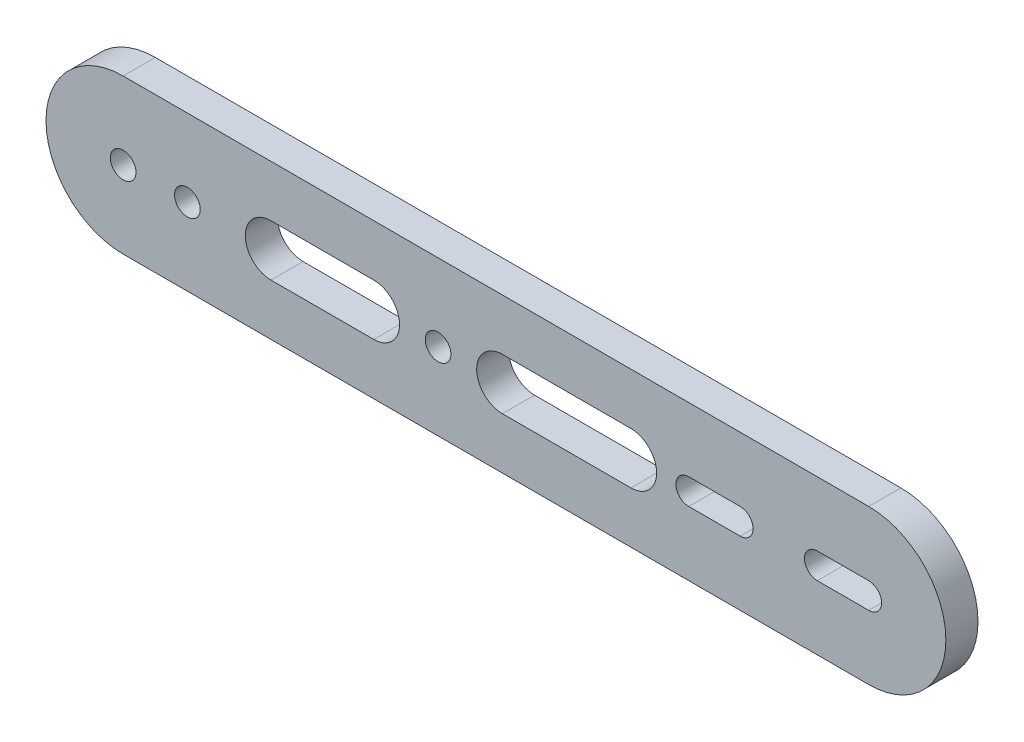
ISO-10303-21;
HEADER;
FILE_DESCRIPTION(('STEP AP214'),'2;1');
FILE_NAME('part.step','',(''),(''),'','','');
FILE_SCHEMA(('AUTOMOTIVE_DESIGN { 1 0 10303 214 1 1 1 1 }'));
ENDSEC;
DATA;
#1=APPLICATION_CONTEXT('core data for automotive mechanical design processes');
#2=APPLICATION_PROTOCOL_DEFINITION('international standard','automotive_design',2000,#1);
#3=PRODUCT_CONTEXT('',#1,'mechanical');
#4=PRODUCT('Part','Part','',(#3));
#5=PRODUCT_RELATED_PRODUCT_CATEGORY('part','',(#4));
#6=PRODUCT_DEFINITION_FORMATION('','',#4);
#7=PRODUCT_DEFINITION_CONTEXT('part definition',#1,'design');
#8=PRODUCT_DEFINITION('design','',#6,#7);
#9=PRODUCT_DEFINITION_SHAPE('','',#8);
#10=(LENGTH_UNIT() NAMED_UNIT(*) SI_UNIT(.MILLI.,.METRE.));
#11=(NAMED_UNIT(*) PLANE_ANGLE_UNIT() SI_UNIT($,.RADIAN.));
#12=(NAMED_UNIT(*) SI_UNIT($,.STERADIAN.) SOLID_ANGLE_UNIT());
#13=UNCERTAINTY_MEASURE_WITH_UNIT(LENGTH_MEASURE(1.E-05),#10,'distance_accuracy_value','');
#14=(GEOMETRIC_REPRESENTATION_CONTEXT(3) GLOBAL_UNCERTAINTY_ASSIGNED_CONTEXT((#13)) GLOBAL_UNIT_ASSIGNED_CONTEXT((#10,
#11,#12)) REPRESENTATION_CONTEXT('',''));
#15=CARTESIAN_POINT('',(0.,0.,0.));
#16=DIRECTION('',(0.,0.,1.));
#17=DIRECTION('',(1.,0.,0.));
#18=AXIS2_PLACEMENT_3D('',#15,#16,#17);
#19=CARTESIAN_POINT('',(0.,0.,5.));
#20=DIRECTION('',(0.,0.,1.));
#21=DIRECTION('',(1.,0.,0.));
#22=AXIS2_PLACEMENT_3D('',#19,#20,#21);
#23=PLANE('',#22);
#24=CARTESIAN_POINT('',(0.,0.,5.));
#25=DIRECTION('',(0.,0.,1.));
#26=DIRECTION('',(1.,0.,0.));
#27=AXIS2_PLACEMENT_3D('',#24,#25,#26);
#28=CIRCLE('',#27,2.);
#29=CARTESIAN_POINT('',(2.,0.,5.));
#30=VERTEX_POINT('',#29);
#31=EDGE_CURVE('E308',#30,#30,#28,.T.);
#32=ORIENTED_EDGE('',*,*,#31,.F.);
#33=EDGE_LOOP('',(#32));
#34=FACE_BOUND('',#33,.T.);
#35=CARTESIAN_POINT('',(0.,0.,5.));
#36=DIRECTION('',(0.,0.,1.));
#37=DIRECTION('',(1.,0.,0.));
#38=AXIS2_PLACEMENT_3D('',#35,#36,#37);
#39=CIRCLE('',#38,12.);
#40=CARTESIAN_POINT('',(0.,12.,5.));
#41=VERTEX_POINT('',#40);
#42=CARTESIAN_POINT('',(0.,-12.,5.));
#43=VERTEX_POINT('',#42);
#44=EDGE_CURVE('E320',#41,#43,#39,.T.);
#45=ORIENTED_EDGE('',*,*,#44,.T.);
#46=DIRECTION('',(1.,0.,0.));
#47=VECTOR('',#46,1.);
#48=CARTESIAN_POINT('',(0.,-12.,5.));
#49=LINE('',#48,#47);
#50=CARTESIAN_POINT('',(116.,-12.,5.));
#51=VERTEX_POINT('',#50);
#52=EDGE_CURVE('E323',#43,#51,#49,.T.);
#53=ORIENTED_EDGE('',*,*,#52,.T.);
#54=CARTESIAN_POINT('',(116.,0.,5.));
#55=DIRECTION('',(0.,0.,1.));
#56=DIRECTION('',(1.,0.,0.));
#57=AXIS2_PLACEMENT_3D('',#54,#55,#56);
#58=CIRCLE('',#57,12.);
#59=CARTESIAN_POINT('',(116.,12.,5.));
#60=VERTEX_POINT('',#59);
#61=EDGE_CURVE('E326',#51,#60,#58,.T.);
#62=ORIENTED_EDGE('',*,*,#61,.T.);
#63=DIRECTION('',(-1.,0.,0.));
#64=VECTOR('',#63,1.);
#65=CARTESIAN_POINT('',(0.,12.,5.));
#66=LINE('',#65,#64);
#67=EDGE_CURVE('E328',#60,#41,#66,.T.);
#68=ORIENTED_EDGE('',*,*,#67,.T.);
#69=EDGE_LOOP('',(#45,#53,#62,#68));
#70=FACE_BOUND('',#69,.T.);
#71=CARTESIAN_POINT('',(49.,0.,5.));
#72=DIRECTION('',(0.,0.,1.));
#73=DIRECTION('',(1.,0.,0.));
#74=AXIS2_PLACEMENT_3D('',#71,#72,#73);
#75=CIRCLE('',#74,2.);
#76=CARTESIAN_POINT('',(51.,0.,5.));
#77=VERTEX_POINT('',#76);
#78=EDGE_CURVE('E314',#77,#77,#75,.T.);
#79=ORIENTED_EDGE('',*,*,#78,.F.);
#80=EDGE_LOOP('',(#79));
#81=FACE_BOUND('',#80,.T.);
#82=CARTESIAN_POINT('',(10.,0.,5.));
#83=DIRECTION('',(0.,0.,1.));
#84=DIRECTION('',(1.,0.,0.));
#85=AXIS2_PLACEMENT_3D('',#82,#83,#84);
#86=CIRCLE('',#85,2.);
#87=CARTESIAN_POINT('',(12.,0.,5.));
#88=VERTEX_POINT('',#87);
#89=EDGE_CURVE('E302',#88,#88,#86,.T.);
#90=ORIENTED_EDGE('',*,*,#89,.F.);
#91=EDGE_LOOP('',(#90));
#92=FACE_BOUND('',#91,.T.);
#93=DIRECTION('',(1.,0.,0.));
#94=VECTOR('',#93,1.);
#95=CARTESIAN_POINT('',(23.,-4.,5.));
#96=LINE('',#95,#94);
#97=CARTESIAN_POINT('',(23.,-4.,5.));
#98=VERTEX_POINT('',#97);
#99=CARTESIAN_POINT('',(39.,-4.,5.));
#100=VERTEX_POINT('',#99);
#101=EDGE_CURVE('E273',#98,#100,#96,.T.);
#102=ORIENTED_EDGE('',*,*,#101,.F.);
#103=CARTESIAN_POINT('',(23.,0.,5.));
#104=DIRECTION('',(0.,0.,1.));
#105=DIRECTION('',(1.,0.,0.));
#106=AXIS2_PLACEMENT_3D('',#103,#104,#105);
#107=CIRCLE('',#106,4.);
#108=CARTESIAN_POINT('',(23.,4.,5.));
#109=VERTEX_POINT('',#108);
#110=EDGE_CURVE('E271',#109,#98,#107,.T.);
#111=ORIENTED_EDGE('',*,*,#110,.F.);
#112=DIRECTION('',(-1.,0.,0.));
#113=VECTOR('',#112,1.);
#114=CARTESIAN_POINT('',(23.,4.,5.));
#115=LINE('',#114,#113);
#116=CARTESIAN_POINT('',(39.,4.,5.));
#117=VERTEX_POINT('',#116);
#118=EDGE_CURVE('E279',#117,#109,#115,.T.);
#119=ORIENTED_EDGE('',*,*,#118,.F.);
#120=CARTESIAN_POINT('',(39.,0.,5.));
#121=DIRECTION('',(0.,0.,1.));
#122=DIRECTION('',(1.,0.,0.));
#123=AXIS2_PLACEMENT_3D('',#120,#121,#122);
#124=CIRCLE('',#123,4.);
#125=EDGE_CURVE('E276',#100,#117,#124,.T.);
#126=ORIENTED_EDGE('',*,*,#125,.F.);
#127=EDGE_LOOP('',(#102,#111,#119,#126));
#128=FACE_BOUND('',#127,.T.);
#129=DIRECTION('',(1.,0.,0.));
#130=VECTOR('',#129,1.);
#131=CARTESIAN_POINT('',(59.,-4.,5.));
#132=LINE('',#131,#130);
#133=CARTESIAN_POINT('',(59.,-4.,5.));
#134=VERTEX_POINT('',#133);
#135=CARTESIAN_POINT('',(79.,-4.,5.));
#136=VERTEX_POINT('',#135);
#137=EDGE_CURVE('E242',#134,#136,#132,.T.);
#138=ORIENTED_EDGE('',*,*,#137,.F.);
#139=CARTESIAN_POINT('',(59.,0.,5.));
#140=DIRECTION('',(0.,0.,1.));
#141=DIRECTION('',(1.,0.,0.));
#142=AXIS2_PLACEMENT_3D('',#139,#140,#141);
#143=CIRCLE('',#142,4.);
#144=CARTESIAN_POINT('',(59.,4.,5.));
#145=VERTEX_POINT('',#144);
#146=EDGE_CURVE('E240',#145,#134,#143,.T.);
#147=ORIENTED_EDGE('',*,*,#146,.F.);
#148=DIRECTION('',(-1.,0.,0.));
#149=VECTOR('',#148,1.);
#150=CARTESIAN_POINT('',(59.,4.,5.));
#151=LINE('',#150,#149);
#152=CARTESIAN_POINT('',(79.,4.,5.));
#153=VERTEX_POINT('',#152);
#154=EDGE_CURVE('E248',#153,#145,#151,.T.);
#155=ORIENTED_EDGE('',*,*,#154,.F.);
#156=CARTESIAN_POINT('',(79.,0.,5.));
#157=DIRECTION('',(0.,0.,1.));
#158=DIRECTION('',(1.,0.,0.));
#159=AXIS2_PLACEMENT_3D('',#156,#157,#158);
#160=CIRCLE('',#159,4.);
#161=EDGE_CURVE('E245',#136,#153,#160,.T.);
#162=ORIENTED_EDGE('',*,*,#161,.F.);
#163=EDGE_LOOP('',(#138,#147,#155,#162));
#164=FACE_BOUND('',#163,.T.);
#165=DIRECTION('',(1.,0.,0.));
#166=VECTOR('',#165,1.);
#167=CARTESIAN_POINT('',(108.,-2.,5.));
#168=LINE('',#167,#166);
#169=CARTESIAN_POINT('',(108.,-2.,5.));
#170=VERTEX_POINT('',#169);
#171=CARTESIAN_POINT('',(116.,-2.,5.));
#172=VERTEX_POINT('',#171);
#173=EDGE_CURVE('E211',#170,#172,#168,.T.);
#174=ORIENTED_EDGE('',*,*,#173,.F.);
#175=CARTESIAN_POINT('',(108.,0.,5.));
#176=DIRECTION('',(0.,0.,1.));
#177=DIRECTION('',(1.,0.,0.));
#178=AXIS2_PLACEMENT_3D('',#175,#176,#177);
#179=CIRCLE('',#178,2.);
#180=CARTESIAN_POINT('',(108.,2.,5.));
#181=VERTEX_POINT('',#180);
#182=EDGE_CURVE('E209',#181,#170,#179,.T.);
#183=ORIENTED_EDGE('',*,*,#182,.F.);
#184=DIRECTION('',(-1.,0.,0.));
#185=VECTOR('',#184,1.);
#186=CARTESIAN_POINT('',(108.,2.,5.));
#187=LINE('',#186,#185);
#188=CARTESIAN_POINT('',(116.,2.,5.));
#189=VERTEX_POINT('',#188);
#190=EDGE_CURVE('E217',#189,#181,#187,.T.);
#191=ORIENTED_EDGE('',*,*,#190,.F.);
#192=CARTESIAN_POINT('',(116.,0.,5.));
#193=DIRECTION('',(0.,0.,1.));
#194=DIRECTION('',(1.,0.,0.));
#195=AXIS2_PLACEMENT_3D('',#192,#193,#194);
#196=CIRCLE('',#195,2.);
#197=EDGE_CURVE('E214',#172,#189,#196,.T.);
#198=ORIENTED_EDGE('',*,*,#197,.F.);
#199=EDGE_LOOP('',(#174,#183,#191,#198));
#200=FACE_BOUND('',#199,.T.);
#201=DIRECTION('',(1.,0.,0.));
#202=VECTOR('',#201,1.);
#203=CARTESIAN_POINT('',(88.,-2.,5.));
#204=LINE('',#203,#202);
#205=CARTESIAN_POINT('',(88.,-2.,5.));
#206=VERTEX_POINT('',#205);
#207=CARTESIAN_POINT('',(96.,-2.,5.));
#208=VERTEX_POINT('',#207);
#209=EDGE_CURVE('E181',#206,#208,#204,.T.);
#210=ORIENTED_EDGE('',*,*,#209,.F.);
#211=CARTESIAN_POINT('',(88.,0.,5.));
#212=DIRECTION('',(0.,0.,1.));
#213=DIRECTION('',(1.,0.,0.));
#214=AXIS2_PLACEMENT_3D('',#211,#212,#213);
#215=CIRCLE('',#214,2.);
#216=CARTESIAN_POINT('',(88.,2.,5.));
#217=VERTEX_POINT('',#216);
#218=EDGE_CURVE('E173',#217,#206,#215,.T.);
#219=ORIENTED_EDGE('',*,*,#218,.F.);
#220=DIRECTION('',(-1.,0.,0.));
#221=VECTOR('',#220,1.);
#222=CARTESIAN_POINT('',(88.,2.,5.));
#223=LINE('',#222,#221);
#224=CARTESIAN_POINT('',(96.,2.,5.));
#225=VERTEX_POINT('',#224);
#226=EDGE_CURVE('E195',#225,#217,#223,.T.);
#227=ORIENTED_EDGE('',*,*,#226,.F.);
#228=CARTESIAN_POINT('',(96.,0.,5.));
#229=DIRECTION('',(0.,0.,1.));
#230=DIRECTION('',(1.,0.,0.));
#231=AXIS2_PLACEMENT_3D('',#228,#229,#230);
#232=CIRCLE('',#231,2.);
#233=EDGE_CURVE('E193',#208,#225,#232,.T.);
#234=ORIENTED_EDGE('',*,*,#233,.F.);
#235=EDGE_LOOP('',(#210,#219,#227,#234));
#236=FACE_BOUND('',#235,.T.);
#237=ADVANCED_FACE('F36',(#34,#70,#81,#92,#128,#164,#200,#236),#23,.T.);
#238=CARTESIAN_POINT('',(0.,0.,0.));
#239=DIRECTION('',(0.,0.,1.));
#240=DIRECTION('',(1.,0.,0.));
#241=AXIS2_PLACEMENT_3D('',#238,#239,#240);
#242=PLANE('',#241);
#243=CARTESIAN_POINT('',(108.,0.,0.));
#244=DIRECTION('',(0.,0.,1.));
#245=DIRECTION('',(1.,0.,0.));
#246=AXIS2_PLACEMENT_3D('',#243,#244,#245);
#247=CIRCLE('',#246,2.);
#248=CARTESIAN_POINT('',(108.,2.,0.));
#249=VERTEX_POINT('',#248);
#250=CARTESIAN_POINT('',(108.,-2.,0.));
#251=VERTEX_POINT('',#250);
#252=EDGE_CURVE('E189',#249,#251,#247,.T.);
#253=ORIENTED_EDGE('',*,*,#252,.T.);
#254=DIRECTION('',(1.,0.,0.));
#255=VECTOR('',#254,1.);
#256=CARTESIAN_POINT('',(108.,-2.,0.));
#257=LINE('',#256,#255);
#258=CARTESIAN_POINT('',(116.,-2.,0.));
#259=VERTEX_POINT('',#258);
#260=EDGE_CURVE('E222',#251,#259,#257,.T.);
#261=ORIENTED_EDGE('',*,*,#260,.T.);
#262=CARTESIAN_POINT('',(116.,0.,0.));
#263=DIRECTION('',(0.,0.,1.));
#264=DIRECTION('',(1.,0.,0.));
#265=AXIS2_PLACEMENT_3D('',#262,#263,#264);
#266=CIRCLE('',#265,2.);
#267=CARTESIAN_POINT('',(116.,2.,0.));
#268=VERTEX_POINT('',#267);
#269=EDGE_CURVE('E225',#259,#268,#266,.T.);
#270=ORIENTED_EDGE('',*,*,#269,.T.);
#271=DIRECTION('',(-1.,0.,0.));
#272=VECTOR('',#271,1.);
#273=CARTESIAN_POINT('',(108.,2.,0.));
#274=LINE('',#273,#272);
#275=EDGE_CURVE('E212',#268,#249,#274,.T.);
#276=ORIENTED_EDGE('',*,*,#275,.T.);
#277=EDGE_LOOP('',(#253,#261,#270,#276));
#278=FACE_BOUND('',#277,.T.);
#279=CARTESIAN_POINT('',(23.,0.,0.));
#280=DIRECTION('',(0.,0.,1.));
#281=DIRECTION('',(1.,0.,0.));
#282=AXIS2_PLACEMENT_3D('',#279,#280,#281);
#283=CIRCLE('',#282,4.);
#284=CARTESIAN_POINT('',(23.,4.,0.));
#285=VERTEX_POINT('',#284);
#286=CARTESIAN_POINT('',(23.,-4.,0.));
#287=VERTEX_POINT('',#286);
#288=EDGE_CURVE('E270',#285,#287,#283,.T.);
#289=ORIENTED_EDGE('',*,*,#288,.T.);
#290=DIRECTION('',(1.,0.,0.));
#291=VECTOR('',#290,1.);
#292=CARTESIAN_POINT('',(23.,-4.,0.));
#293=LINE('',#292,#291);
#294=CARTESIAN_POINT('',(39.,-4.,0.));
#295=VERTEX_POINT('',#294);
#296=EDGE_CURVE('E284',#287,#295,#293,.T.);
#297=ORIENTED_EDGE('',*,*,#296,.T.);
#298=CARTESIAN_POINT('',(39.,0.,0.));
#299=DIRECTION('',(0.,0.,1.));
#300=DIRECTION('',(1.,0.,0.));
#301=AXIS2_PLACEMENT_3D('',#298,#299,#300);
#302=CIRCLE('',#301,4.);
#303=CARTESIAN_POINT('',(39.,4.,0.));
#304=VERTEX_POINT('',#303);
#305=EDGE_CURVE('E287',#295,#304,#302,.T.);
#306=ORIENTED_EDGE('',*,*,#305,.T.);
#307=DIRECTION('',(-1.,0.,0.));
#308=VECTOR('',#307,1.);
#309=CARTESIAN_POINT('',(23.,4.,0.));
#310=LINE('',#309,#308);
#311=EDGE_CURVE('E274',#304,#285,#310,.T.);
#312=ORIENTED_EDGE('',*,*,#311,.T.);
#313=EDGE_LOOP('',(#289,#297,#306,#312));
#314=FACE_BOUND('',#313,.T.);
#315=CARTESIAN_POINT('',(0.,0.,0.));
#316=DIRECTION('',(0.,0.,1.));
#317=DIRECTION('',(1.,0.,0.));
#318=AXIS2_PLACEMENT_3D('',#315,#316,#317);
#319=CIRCLE('',#318,12.);
#320=CARTESIAN_POINT('',(0.,12.,0.));
#321=VERTEX_POINT('',#320);
#322=CARTESIAN_POINT('',(0.,-12.,0.));
#323=VERTEX_POINT('',#322);
#324=EDGE_CURVE('E317',#321,#323,#319,.T.);
#325=ORIENTED_EDGE('',*,*,#324,.F.);
#326=DIRECTION('',(-1.,0.,0.));
#327=VECTOR('',#326,1.);
#328=CARTESIAN_POINT('',(0.,12.,0.));
#329=LINE('',#328,#327);
#330=CARTESIAN_POINT('',(116.,12.,0.));
#331=VERTEX_POINT('',#330);
#332=EDGE_CURVE('E324',#331,#321,#329,.T.);
#333=ORIENTED_EDGE('',*,*,#332,.F.);
#334=CARTESIAN_POINT('',(116.,0.,0.));
#335=DIRECTION('',(0.,0.,1.));
#336=DIRECTION('',(1.,0.,0.));
#337=AXIS2_PLACEMENT_3D('',#334,#335,#336);
#338=CIRCLE('',#337,12.);
#339=CARTESIAN_POINT('',(116.,-12.,0.));
#340=VERTEX_POINT('',#339);
#341=EDGE_CURVE('E335',#340,#331,#338,.T.);
#342=ORIENTED_EDGE('',*,*,#341,.F.);
#343=DIRECTION('',(1.,0.,0.));
#344=VECTOR('',#343,1.);
#345=CARTESIAN_POINT('',(0.,-12.,0.));
#346=LINE('',#345,#344);
#347=EDGE_CURVE('E333',#323,#340,#346,.T.);
#348=ORIENTED_EDGE('',*,*,#347,.F.);
#349=EDGE_LOOP('',(#325,#333,#342,#348));
#350=FACE_BOUND('',#349,.T.);
#351=CARTESIAN_POINT('',(49.,0.,0.));
#352=DIRECTION('',(0.,0.,1.));
#353=DIRECTION('',(1.,0.,0.));
#354=AXIS2_PLACEMENT_3D('',#351,#352,#353);
#355=CIRCLE('',#354,2.);
#356=CARTESIAN_POINT('',(51.,0.,0.));
#357=VERTEX_POINT('',#356);
#358=EDGE_CURVE('E311',#357,#357,#355,.T.);
#359=ORIENTED_EDGE('',*,*,#358,.T.);
#360=EDGE_LOOP('',(#359));
#361=FACE_BOUND('',#360,.T.);
#362=CARTESIAN_POINT('',(0.,0.,0.));
#363=DIRECTION('',(0.,0.,1.));
#364=DIRECTION('',(1.,0.,0.));
#365=AXIS2_PLACEMENT_3D('',#362,#363,#364);
#366=CIRCLE('',#365,2.);
#367=CARTESIAN_POINT('',(2.,0.,0.));
#368=VERTEX_POINT('',#367);
#369=EDGE_CURVE('E305',#368,#368,#366,.T.);
#370=ORIENTED_EDGE('',*,*,#369,.T.);
#371=EDGE_LOOP('',(#370));
#372=FACE_BOUND('',#371,.T.);
#373=CARTESIAN_POINT('',(10.,0.,0.));
#374=DIRECTION('',(0.,0.,1.));
#375=DIRECTION('',(1.,0.,0.));
#376=AXIS2_PLACEMENT_3D('',#373,#374,#375);
#377=CIRCLE('',#376,2.);
#378=CARTESIAN_POINT('',(12.,0.,0.));
#379=VERTEX_POINT('',#378);
#380=EDGE_CURVE('E301',#379,#379,#377,.T.);
#381=ORIENTED_EDGE('',*,*,#380,.T.);
#382=EDGE_LOOP('',(#381));
#383=FACE_BOUND('',#382,.T.);
#384=CARTESIAN_POINT('',(59.,0.,0.));
#385=DIRECTION('',(0.,0.,1.));
#386=DIRECTION('',(1.,0.,0.));
#387=AXIS2_PLACEMENT_3D('',#384,#385,#386);
#388=CIRCLE('',#387,4.);
#389=CARTESIAN_POINT('',(59.,4.,0.));
#390=VERTEX_POINT('',#389);
#391=CARTESIAN_POINT('',(59.,-4.,0.));
#392=VERTEX_POINT('',#391);
#393=EDGE_CURVE('E239',#390,#392,#388,.T.);
#394=ORIENTED_EDGE('',*,*,#393,.T.);
#395=DIRECTION('',(1.,0.,0.));
#396=VECTOR('',#395,1.);
#397=CARTESIAN_POINT('',(59.,-4.,0.));
#398=LINE('',#397,#396);
#399=CARTESIAN_POINT('',(79.,-4.,0.));
#400=VERTEX_POINT('',#399);
#401=EDGE_CURVE('E253',#392,#400,#398,.T.);
#402=ORIENTED_EDGE('',*,*,#401,.T.);
#403=CARTESIAN_POINT('',(79.,0.,0.));
#404=DIRECTION('',(0.,0.,1.));
#405=DIRECTION('',(1.,0.,0.));
#406=AXIS2_PLACEMENT_3D('',#403,#404,#405);
#407=CIRCLE('',#406,4.);
#408=CARTESIAN_POINT('',(79.,4.,0.));
#409=VERTEX_POINT('',#408);
#410=EDGE_CURVE('E256',#400,#409,#407,.T.);
#411=ORIENTED_EDGE('',*,*,#410,.T.);
#412=DIRECTION('',(-1.,0.,0.));
#413=VECTOR('',#412,1.);
#414=CARTESIAN_POINT('',(59.,4.,0.));
#415=LINE('',#414,#413);
#416=EDGE_CURVE('E243',#409,#390,#415,.T.);
#417=ORIENTED_EDGE('',*,*,#416,.T.);
#418=EDGE_LOOP('',(#394,#402,#411,#417));
#419=FACE_BOUND('',#418,.T.);
#420=CARTESIAN_POINT('',(88.,0.,0.));
#421=DIRECTION('',(0.,0.,1.));
#422=DIRECTION('',(1.,0.,0.));
#423=AXIS2_PLACEMENT_3D('',#420,#421,#422);
#424=CIRCLE('',#423,2.);
#425=CARTESIAN_POINT('',(88.,2.,0.));
#426=VERTEX_POINT('',#425);
#427=CARTESIAN_POINT('',(88.,-2.,0.));
#428=VERTEX_POINT('',#427);
#429=EDGE_CURVE('E59',#426,#428,#424,.T.);
#430=ORIENTED_EDGE('',*,*,#429,.T.);
#431=DIRECTION('',(1.,0.,0.));
#432=VECTOR('',#431,1.);
#433=CARTESIAN_POINT('',(88.,-2.,0.));
#434=LINE('',#433,#432);
#435=CARTESIAN_POINT('',(96.,-2.,0.));
#436=VERTEX_POINT('',#435);
#437=EDGE_CURVE('E188',#428,#436,#434,.T.);
#438=ORIENTED_EDGE('',*,*,#437,.T.);
#439=CARTESIAN_POINT('',(96.,0.,0.));
#440=DIRECTION('',(0.,0.,1.));
#441=DIRECTION('',(1.,0.,0.));
#442=AXIS2_PLACEMENT_3D('',#439,#440,#441);
#443=CIRCLE('',#442,2.);
#444=CARTESIAN_POINT('',(96.,2.,0.));
#445=VERTEX_POINT('',#444);
#446=EDGE_CURVE('E201',#436,#445,#443,.T.);
#447=ORIENTED_EDGE('',*,*,#446,.T.);
#448=DIRECTION('',(-1.,0.,0.));
#449=VECTOR('',#448,1.);
#450=CARTESIAN_POINT('',(88.,2.,0.));
#451=LINE('',#450,#449);
#452=EDGE_CURVE('E182',#445,#426,#451,.T.);
#453=ORIENTED_EDGE('',*,*,#452,.T.);
#454=EDGE_LOOP('',(#430,#438,#447,#453));
#455=FACE_BOUND('',#454,.T.);
#456=ADVANCED_FACE('F353',(#278,#314,#350,#361,#372,#383,#419,#455),#242,.F.);
#457=CARTESIAN_POINT('',(0.,0.,5.));
#458=DIRECTION('',(0.,0.,-1.));
#459=DIRECTION('',(-1.,0.,0.));
#460=AXIS2_PLACEMENT_3D('',#457,#458,#459);
#461=CYLINDRICAL_SURFACE('',#460,12.);
#462=ORIENTED_EDGE('',*,*,#324,.T.);
#463=DIRECTION('',(0.,0.,-1.));
#464=VECTOR('',#463,1.);
#465=CARTESIAN_POINT('',(0.,-12.,5.));
#466=LINE('',#465,#464);
#467=EDGE_CURVE('E11',#43,#323,#466,.T.);
#468=ORIENTED_EDGE('',*,*,#467,.F.);
#469=ORIENTED_EDGE('',*,*,#44,.F.);
#470=DIRECTION('',(0.,0.,-1.));
#471=VECTOR('',#470,1.);
#472=CARTESIAN_POINT('',(0.,12.,5.));
#473=LINE('',#472,#471);
#474=EDGE_CURVE('E330',#41,#321,#473,.T.);
#475=ORIENTED_EDGE('',*,*,#474,.T.);
#476=EDGE_LOOP('',(#462,#468,#469,#475));
#477=FACE_BOUND('',#476,.T.);
#478=ADVANCED_FACE('F38',(#477),#461,.T.);
#479=CARTESIAN_POINT('',(0.,-12.,5.));
#480=DIRECTION('',(0.,1.,0.));
#481=DIRECTION('',(0.,0.,1.));
#482=AXIS2_PLACEMENT_3D('',#479,#480,#481);
#483=PLANE('',#482);
#484=ORIENTED_EDGE('',*,*,#347,.T.);
#485=DIRECTION('',(0.,0.,-1.));
#486=VECTOR('',#485,1.);
#487=CARTESIAN_POINT('',(116.,-12.,5.));
#488=LINE('',#487,#486);
#489=EDGE_CURVE('E44',#51,#340,#488,.T.);
#490=ORIENTED_EDGE('',*,*,#489,.F.);
#491=ORIENTED_EDGE('',*,*,#52,.F.);
#492=ORIENTED_EDGE('',*,*,#467,.T.);
#493=EDGE_LOOP('',(#484,#490,#491,#492));
#494=FACE_BOUND('',#493,.T.);
#495=ADVANCED_FACE('F364',(#494),#483,.F.);
#496=CARTESIAN_POINT('',(116.,0.,5.));
#497=DIRECTION('',(0.,0.,-1.));
#498=DIRECTION('',(-1.,0.,0.));
#499=AXIS2_PLACEMENT_3D('',#496,#497,#498);
#500=CYLINDRICAL_SURFACE('',#499,12.);
#501=ORIENTED_EDGE('',*,*,#341,.T.);
#502=DIRECTION('',(0.,0.,-1.));
#503=VECTOR('',#502,1.);
#504=CARTESIAN_POINT('',(116.,12.,5.));
#505=LINE('',#504,#503);
#506=EDGE_CURVE('E340',#60,#331,#505,.T.);
#507=ORIENTED_EDGE('',*,*,#506,.F.);
#508=ORIENTED_EDGE('',*,*,#61,.F.);
#509=ORIENTED_EDGE('',*,*,#489,.T.);
#510=EDGE_LOOP('',(#501,#507,#508,#509));
#511=FACE_BOUND('',#510,.T.);
#512=ADVANCED_FACE('F347',(#511),#500,.T.);
#513=CARTESIAN_POINT('',(0.,12.,5.));
#514=DIRECTION('',(0.,-1.,0.));
#515=DIRECTION('',(0.,0.,-1.));
#516=AXIS2_PLACEMENT_3D('',#513,#514,#515);
#517=PLANE('',#516);
#518=ORIENTED_EDGE('',*,*,#332,.T.);
#519=ORIENTED_EDGE('',*,*,#474,.F.);
#520=ORIENTED_EDGE('',*,*,#67,.F.);
#521=ORIENTED_EDGE('',*,*,#506,.T.);
#522=EDGE_LOOP('',(#518,#519,#520,#521));
#523=FACE_BOUND('',#522,.T.);
#524=ADVANCED_FACE('F357',(#523),#517,.F.);
#525=CARTESIAN_POINT('',(49.,0.,5.));
#526=DIRECTION('',(0.,0.,-1.));
#527=DIRECTION('',(-1.,0.,0.));
#528=AXIS2_PLACEMENT_3D('',#525,#526,#527);
#529=CYLINDRICAL_SURFACE('',#528,2.);
#530=ORIENTED_EDGE('',*,*,#78,.T.);
#531=EDGE_LOOP('',(#530));
#532=FACE_BOUND('',#531,.T.);
#533=ORIENTED_EDGE('',*,*,#358,.F.);
#534=EDGE_LOOP('',(#533));
#535=FACE_BOUND('',#534,.T.);
#536=ADVANCED_FACE('F381',(#532,#535),#529,.F.);
#537=CARTESIAN_POINT('',(0.,0.,5.));
#538=DIRECTION('',(0.,0.,-1.));
#539=DIRECTION('',(-1.,0.,0.));
#540=AXIS2_PLACEMENT_3D('',#537,#538,#539);
#541=CYLINDRICAL_SURFACE('',#540,2.);
#542=ORIENTED_EDGE('',*,*,#31,.T.);
#543=EDGE_LOOP('',(#542));
#544=FACE_BOUND('',#543,.T.);
#545=ORIENTED_EDGE('',*,*,#369,.F.);
#546=EDGE_LOOP('',(#545));
#547=FACE_BOUND('',#546,.T.);
#548=ADVANCED_FACE('F388',(#544,#547),#541,.F.);
#549=CARTESIAN_POINT('',(10.,0.,5.));
#550=DIRECTION('',(0.,0.,-1.));
#551=DIRECTION('',(-1.,0.,0.));
#552=AXIS2_PLACEMENT_3D('',#549,#550,#551);
#553=CYLINDRICAL_SURFACE('',#552,2.);
#554=ORIENTED_EDGE('',*,*,#89,.T.);
#555=EDGE_LOOP('',(#554));
#556=FACE_BOUND('',#555,.T.);
#557=ORIENTED_EDGE('',*,*,#380,.F.);
#558=EDGE_LOOP('',(#557));
#559=FACE_BOUND('',#558,.T.);
#560=ADVANCED_FACE('F393',(#556,#559),#553,.F.);
#561=CARTESIAN_POINT('',(23.,0.,5.));
#562=DIRECTION('',(0.,0.,-1.));
#563=DIRECTION('',(-1.,0.,0.));
#564=AXIS2_PLACEMENT_3D('',#561,#562,#563);
#565=CYLINDRICAL_SURFACE('',#564,4.);
#566=ORIENTED_EDGE('',*,*,#288,.F.);
#567=DIRECTION('',(0.,0.,-1.));
#568=VECTOR('',#567,1.);
#569=CARTESIAN_POINT('',(23.,4.,5.));
#570=LINE('',#569,#568);
#571=EDGE_CURVE('E281',#109,#285,#570,.T.);
#572=ORIENTED_EDGE('',*,*,#571,.F.);
#573=ORIENTED_EDGE('',*,*,#110,.T.);
#574=DIRECTION('',(0.,0.,-1.));
#575=VECTOR('',#574,1.);
#576=CARTESIAN_POINT('',(23.,-4.,5.));
#577=LINE('',#576,#575);
#578=EDGE_CURVE('E298',#98,#287,#577,.T.);
#579=ORIENTED_EDGE('',*,*,#578,.T.);
#580=EDGE_LOOP('',(#566,#572,#573,#579));
#581=FACE_BOUND('',#580,.T.);
#582=ADVANCED_FACE('F462',(#581),#565,.F.);
#583=CARTESIAN_POINT('',(23.,-4.,5.));
#584=DIRECTION('',(0.,1.,0.));
#585=DIRECTION('',(0.,0.,1.));
#586=AXIS2_PLACEMENT_3D('',#583,#584,#585);
#587=PLANE('',#586);
#588=ORIENTED_EDGE('',*,*,#296,.F.);
#589=ORIENTED_EDGE('',*,*,#578,.F.);
#590=ORIENTED_EDGE('',*,*,#101,.T.);
#591=DIRECTION('',(0.,0.,-1.));
#592=VECTOR('',#591,1.);
#593=CARTESIAN_POINT('',(39.,-4.,5.));
#594=LINE('',#593,#592);
#595=EDGE_CURVE('E296',#100,#295,#594,.T.);
#596=ORIENTED_EDGE('',*,*,#595,.T.);
#597=EDGE_LOOP('',(#588,#589,#590,#596));
#598=FACE_BOUND('',#597,.T.);
#599=ADVANCED_FACE('F458',(#598),#587,.T.);
#600=CARTESIAN_POINT('',(39.,0.,5.));
#601=DIRECTION('',(0.,0.,-1.));
#602=DIRECTION('',(-1.,0.,0.));
#603=AXIS2_PLACEMENT_3D('',#600,#601,#602);
#604=CYLINDRICAL_SURFACE('',#603,4.);
#605=ORIENTED_EDGE('',*,*,#305,.F.);
#606=ORIENTED_EDGE('',*,*,#595,.F.);
#607=ORIENTED_EDGE('',*,*,#125,.T.);
#608=DIRECTION('',(0.,0.,-1.));
#609=VECTOR('',#608,1.);
#610=CARTESIAN_POINT('',(39.,4.,5.));
#611=LINE('',#610,#609);
#612=EDGE_CURVE('E294',#117,#304,#611,.T.);
#613=ORIENTED_EDGE('',*,*,#612,.T.);
#614=EDGE_LOOP('',(#605,#606,#607,#613));
#615=FACE_BOUND('',#614,.T.);
#616=ADVANCED_FACE('F454',(#615),#604,.F.);
#617=CARTESIAN_POINT('',(23.,4.,5.));
#618=DIRECTION('',(0.,-1.,0.));
#619=DIRECTION('',(0.,0.,-1.));
#620=AXIS2_PLACEMENT_3D('',#617,#618,#619);
#621=PLANE('',#620);
#622=ORIENTED_EDGE('',*,*,#311,.F.);
#623=ORIENTED_EDGE('',*,*,#612,.F.);
#624=ORIENTED_EDGE('',*,*,#118,.T.);
#625=ORIENTED_EDGE('',*,*,#571,.T.);
#626=EDGE_LOOP('',(#622,#623,#624,#625));
#627=FACE_BOUND('',#626,.T.);
#628=ADVANCED_FACE('F450',(#627),#621,.T.);
#629=CARTESIAN_POINT('',(59.,0.,5.));
#630=DIRECTION('',(0.,0.,-1.));
#631=DIRECTION('',(-1.,0.,0.));
#632=AXIS2_PLACEMENT_3D('',#629,#630,#631);
#633=CYLINDRICAL_SURFACE('',#632,4.);
#634=ORIENTED_EDGE('',*,*,#393,.F.);
#635=DIRECTION('',(0.,0.,-1.));
#636=VECTOR('',#635,1.);
#637=CARTESIAN_POINT('',(59.,4.,5.));
#638=LINE('',#637,#636);
#639=EDGE_CURVE('E250',#145,#390,#638,.T.);
#640=ORIENTED_EDGE('',*,*,#639,.F.);
#641=ORIENTED_EDGE('',*,*,#146,.T.);
#642=DIRECTION('',(0.,0.,-1.));
#643=VECTOR('',#642,1.);
#644=CARTESIAN_POINT('',(59.,-4.,5.));
#645=LINE('',#644,#643);
#646=EDGE_CURVE('E267',#134,#392,#645,.T.);
#647=ORIENTED_EDGE('',*,*,#646,.T.);
#648=EDGE_LOOP('',(#634,#640,#641,#647));
#649=FACE_BOUND('',#648,.T.);
#650=ADVANCED_FACE('F446',(#649),#633,.F.);
#651=CARTESIAN_POINT('',(59.,-4.,5.));
#652=DIRECTION('',(0.,1.,0.));
#653=DIRECTION('',(0.,0.,1.));
#654=AXIS2_PLACEMENT_3D('',#651,#652,#653);
#655=PLANE('',#654);
#656=ORIENTED_EDGE('',*,*,#401,.F.);
#657=ORIENTED_EDGE('',*,*,#646,.F.);
#658=ORIENTED_EDGE('',*,*,#137,.T.);
#659=DIRECTION('',(0.,0.,-1.));
#660=VECTOR('',#659,1.);
#661=CARTESIAN_POINT('',(79.,-4.,5.));
#662=LINE('',#661,#660);
#663=EDGE_CURVE('E265',#136,#400,#662,.T.);
#664=ORIENTED_EDGE('',*,*,#663,.T.);
#665=EDGE_LOOP('',(#656,#657,#658,#664));
#666=FACE_BOUND('',#665,.T.);
#667=ADVANCED_FACE('F442',(#666),#655,.T.);
#668=CARTESIAN_POINT('',(79.,0.,5.));
#669=DIRECTION('',(0.,0.,-1.));
#670=DIRECTION('',(-1.,0.,0.));
#671=AXIS2_PLACEMENT_3D('',#668,#669,#670);
#672=CYLINDRICAL_SURFACE('',#671,4.);
#673=ORIENTED_EDGE('',*,*,#410,.F.);
#674=ORIENTED_EDGE('',*,*,#663,.F.);
#675=ORIENTED_EDGE('',*,*,#161,.T.);
#676=DIRECTION('',(0.,0.,-1.));
#677=VECTOR('',#676,1.);
#678=CARTESIAN_POINT('',(79.,4.,5.));
#679=LINE('',#678,#677);
#680=EDGE_CURVE('E263',#153,#409,#679,.T.);
#681=ORIENTED_EDGE('',*,*,#680,.T.);
#682=EDGE_LOOP('',(#673,#674,#675,#681));
#683=FACE_BOUND('',#682,.T.);
#684=ADVANCED_FACE('F438',(#683),#672,.F.);
#685=CARTESIAN_POINT('',(59.,4.,5.));
#686=DIRECTION('',(0.,-1.,0.));
#687=DIRECTION('',(0.,0.,-1.));
#688=AXIS2_PLACEMENT_3D('',#685,#686,#687);
#689=PLANE('',#688);
#690=ORIENTED_EDGE('',*,*,#416,.F.);
#691=ORIENTED_EDGE('',*,*,#680,.F.);
#692=ORIENTED_EDGE('',*,*,#154,.T.);
#693=ORIENTED_EDGE('',*,*,#639,.T.);
#694=EDGE_LOOP('',(#690,#691,#692,#693));
#695=FACE_BOUND('',#694,.T.);
#696=ADVANCED_FACE('F434',(#695),#689,.T.);
#697=CARTESIAN_POINT('',(108.,0.,5.));
#698=DIRECTION('',(0.,0.,-1.));
#699=DIRECTION('',(-1.,0.,0.));
#700=AXIS2_PLACEMENT_3D('',#697,#698,#699);
#701=CYLINDRICAL_SURFACE('',#700,2.);
#702=ORIENTED_EDGE('',*,*,#252,.F.);
#703=DIRECTION('',(0.,0.,-1.));
#704=VECTOR('',#703,1.);
#705=CARTESIAN_POINT('',(108.,2.,5.));
#706=LINE('',#705,#704);
#707=EDGE_CURVE('E219',#181,#249,#706,.T.);
#708=ORIENTED_EDGE('',*,*,#707,.F.);
#709=ORIENTED_EDGE('',*,*,#182,.T.);
#710=DIRECTION('',(0.,0.,-1.));
#711=VECTOR('',#710,1.);
#712=CARTESIAN_POINT('',(108.,-2.,5.));
#713=LINE('',#712,#711);
#714=EDGE_CURVE('E236',#170,#251,#713,.T.);
#715=ORIENTED_EDGE('',*,*,#714,.T.);
#716=EDGE_LOOP('',(#702,#708,#709,#715));
#717=FACE_BOUND('',#716,.T.);
#718=ADVANCED_FACE('F430',(#717),#701,.F.);
#719=CARTESIAN_POINT('',(108.,-2.,5.));
#720=DIRECTION('',(0.,1.,0.));
#721=DIRECTION('',(0.,0.,1.));
#722=AXIS2_PLACEMENT_3D('',#719,#720,#721);
#723=PLANE('',#722);
#724=ORIENTED_EDGE('',*,*,#260,.F.);
#725=ORIENTED_EDGE('',*,*,#714,.F.);
#726=ORIENTED_EDGE('',*,*,#173,.T.);
#727=DIRECTION('',(0.,0.,-1.));
#728=VECTOR('',#727,1.);
#729=CARTESIAN_POINT('',(116.,-2.,5.));
#730=LINE('',#729,#728);
#731=EDGE_CURVE('E234',#172,#259,#730,.T.);
#732=ORIENTED_EDGE('',*,*,#731,.T.);
#733=EDGE_LOOP('',(#724,#725,#726,#732));
#734=FACE_BOUND('',#733,.T.);
#735=ADVANCED_FACE('F426',(#734),#723,.T.);
#736=CARTESIAN_POINT('',(116.,0.,5.));
#737=DIRECTION('',(0.,0.,-1.));
#738=DIRECTION('',(-1.,0.,0.));
#739=AXIS2_PLACEMENT_3D('',#736,#737,#738);
#740=CYLINDRICAL_SURFACE('',#739,2.);
#741=ORIENTED_EDGE('',*,*,#269,.F.);
#742=ORIENTED_EDGE('',*,*,#731,.F.);
#743=ORIENTED_EDGE('',*,*,#197,.T.);
#744=DIRECTION('',(0.,0.,-1.));
#745=VECTOR('',#744,1.);
#746=CARTESIAN_POINT('',(116.,2.,5.));
#747=LINE('',#746,#745);
#748=EDGE_CURVE('E232',#189,#268,#747,.T.);
#749=ORIENTED_EDGE('',*,*,#748,.T.);
#750=EDGE_LOOP('',(#741,#742,#743,#749));
#751=FACE_BOUND('',#750,.T.);
#752=ADVANCED_FACE('F422',(#751),#740,.F.);
#753=CARTESIAN_POINT('',(108.,2.,5.));
#754=DIRECTION('',(0.,-1.,0.));
#755=DIRECTION('',(0.,0.,-1.));
#756=AXIS2_PLACEMENT_3D('',#753,#754,#755);
#757=PLANE('',#756);
#758=ORIENTED_EDGE('',*,*,#275,.F.);
#759=ORIENTED_EDGE('',*,*,#748,.F.);
#760=ORIENTED_EDGE('',*,*,#190,.T.);
#761=ORIENTED_EDGE('',*,*,#707,.T.);
#762=EDGE_LOOP('',(#758,#759,#760,#761));
#763=FACE_BOUND('',#762,.T.);
#764=ADVANCED_FACE('F419',(#763),#757,.T.);
#765=CARTESIAN_POINT('',(88.,0.,5.));
#766=DIRECTION('',(0.,0.,-1.));
#767=DIRECTION('',(-1.,0.,0.));
#768=AXIS2_PLACEMENT_3D('',#765,#766,#767);
#769=CYLINDRICAL_SURFACE('',#768,2.);
#770=ORIENTED_EDGE('',*,*,#429,.F.);
#771=DIRECTION('',(0.,0.,-1.));
#772=VECTOR('',#771,1.);
#773=CARTESIAN_POINT('',(88.,2.,5.));
#774=LINE('',#773,#772);
#775=EDGE_CURVE('E177',#217,#426,#774,.T.);
#776=ORIENTED_EDGE('',*,*,#775,.F.);
#777=ORIENTED_EDGE('',*,*,#218,.T.);
#778=DIRECTION('',(0.,0.,-1.));
#779=VECTOR('',#778,1.);
#780=CARTESIAN_POINT('',(88.,-2.,5.));
#781=LINE('',#780,#779);
#782=EDGE_CURVE('E176',#206,#428,#781,.T.);
#783=ORIENTED_EDGE('',*,*,#782,.T.);
#784=EDGE_LOOP('',(#770,#776,#777,#783));
#785=FACE_BOUND('',#784,.T.);
#786=ADVANCED_FACE('F175',(#785),#769,.F.);
#787=CARTESIAN_POINT('',(88.,-2.,5.));
#788=DIRECTION('',(0.,1.,0.));
#789=DIRECTION('',(0.,0.,1.));
#790=AXIS2_PLACEMENT_3D('',#787,#788,#789);
#791=PLANE('',#790);
#792=ORIENTED_EDGE('',*,*,#437,.F.);
#793=ORIENTED_EDGE('',*,*,#782,.F.);
#794=ORIENTED_EDGE('',*,*,#209,.T.);
#795=DIRECTION('',(0.,0.,-1.));
#796=VECTOR('',#795,1.);
#797=CARTESIAN_POINT('',(96.,-2.,5.));
#798=LINE('',#797,#796);
#799=EDGE_CURVE('E190',#208,#436,#798,.T.);
#800=ORIENTED_EDGE('',*,*,#799,.T.);
#801=EDGE_LOOP('',(#792,#793,#794,#800));
#802=FACE_BOUND('',#801,.T.);
#803=ADVANCED_FACE('F185',(#802),#791,.T.);
#804=CARTESIAN_POINT('',(96.,0.,5.));
#805=DIRECTION('',(0.,0.,-1.));
#806=DIRECTION('',(-1.,0.,0.));
#807=AXIS2_PLACEMENT_3D('',#804,#805,#806);
#808=CYLINDRICAL_SURFACE('',#807,2.);
#809=ORIENTED_EDGE('',*,*,#446,.F.);
#810=ORIENTED_EDGE('',*,*,#799,.F.);
#811=ORIENTED_EDGE('',*,*,#233,.T.);
#812=DIRECTION('',(0.,0.,-1.));
#813=VECTOR('',#812,1.);
#814=CARTESIAN_POINT('',(96.,2.,5.));
#815=LINE('',#814,#813);
#816=EDGE_CURVE('E51',#225,#445,#815,.T.);
#817=ORIENTED_EDGE('',*,*,#816,.T.);
#818=EDGE_LOOP('',(#809,#810,#811,#817));
#819=FACE_BOUND('',#818,.T.);
#820=ADVANCED_FACE('F407',(#819),#808,.F.);
#821=CARTESIAN_POINT('',(88.,2.,5.));
#822=DIRECTION('',(0.,-1.,0.));
#823=DIRECTION('',(0.,0.,-1.));
#824=AXIS2_PLACEMENT_3D('',#821,#822,#823);
#825=PLANE('',#824);
#826=ORIENTED_EDGE('',*,*,#452,.F.);
#827=ORIENTED_EDGE('',*,*,#816,.F.);
#828=ORIENTED_EDGE('',*,*,#226,.T.);
#829=ORIENTED_EDGE('',*,*,#775,.T.);
#830=EDGE_LOOP('',(#826,#827,#828,#829));
#831=FACE_BOUND('',#830,.T.);
#832=ADVANCED_FACE('F405',(#831),#825,.T.);
#833=CLOSED_SHELL('',(#237,#456,#478,#495,#512,#524,#536,#548,#560,#582,#599,#616,#628,#650,
#667,#684,#696,#718,#735,#752,#764,#786,#803,#820,#832));
#834=MANIFOLD_SOLID_BREP('B2',#833);
#835=ADVANCED_BREP_SHAPE_REPRESENTATION('',(#18,#834),#14);
#836=SHAPE_DEFINITION_REPRESENTATION(#9,#835);
ENDSEC;
END-ISO-10303-21;
